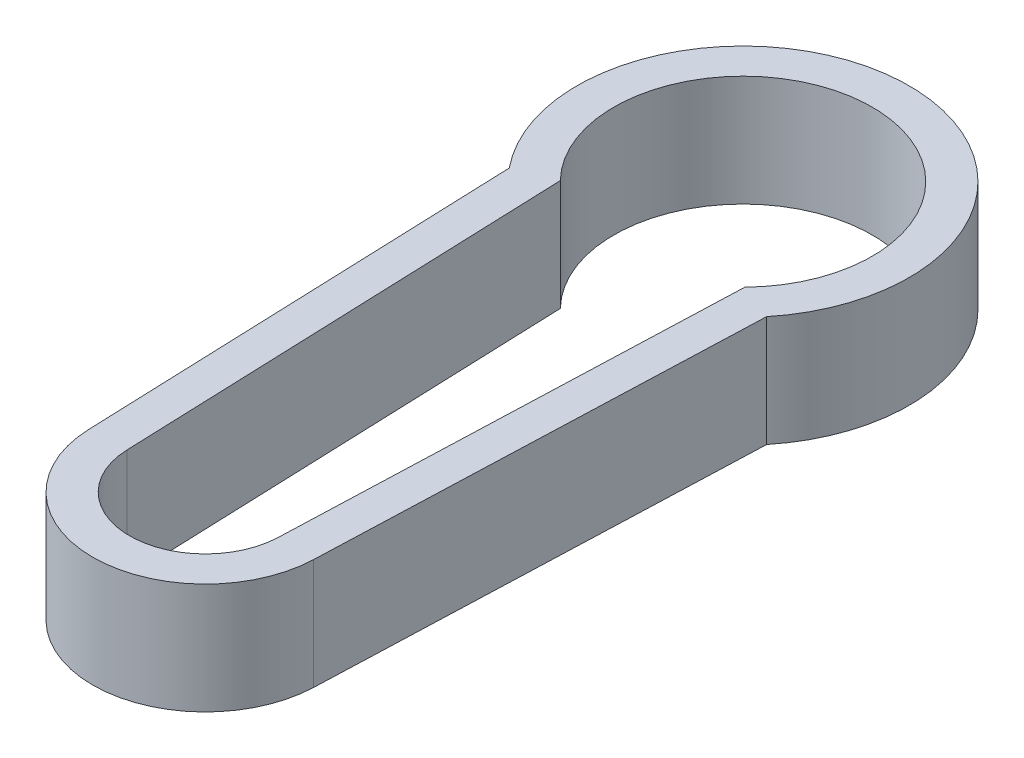
ISO-10303-21;
HEADER;
FILE_DESCRIPTION(('STEP AP214'),'2;1');
FILE_NAME('part.step','',(''),(''),'','','');
FILE_SCHEMA(('AUTOMOTIVE_DESIGN { 1 0 10303 214 1 1 1 1 }'));
ENDSEC;
DATA;
#1=APPLICATION_CONTEXT('core data for automotive mechanical design processes');
#2=APPLICATION_PROTOCOL_DEFINITION('international standard','automotive_design',2000,#1);
#3=PRODUCT_CONTEXT('',#1,'mechanical');
#4=PRODUCT('Part','Part','',(#3));
#5=PRODUCT_RELATED_PRODUCT_CATEGORY('part','',(#4));
#6=PRODUCT_DEFINITION_FORMATION('','',#4);
#7=PRODUCT_DEFINITION_CONTEXT('part definition',#1,'design');
#8=PRODUCT_DEFINITION('design','',#6,#7);
#9=PRODUCT_DEFINITION_SHAPE('','',#8);
#10=(LENGTH_UNIT() NAMED_UNIT(*) SI_UNIT(.MILLI.,.METRE.));
#11=(NAMED_UNIT(*) PLANE_ANGLE_UNIT() SI_UNIT($,.RADIAN.));
#12=(NAMED_UNIT(*) SI_UNIT($,.STERADIAN.) SOLID_ANGLE_UNIT());
#13=UNCERTAINTY_MEASURE_WITH_UNIT(LENGTH_MEASURE(1.E-05),#10,'distance_accuracy_value','');
#14=(GEOMETRIC_REPRESENTATION_CONTEXT(3) GLOBAL_UNCERTAINTY_ASSIGNED_CONTEXT((#13)) GLOBAL_UNIT_ASSIGNED_CONTEXT((#10,
#11,#12)) REPRESENTATION_CONTEXT('',''));
#15=CARTESIAN_POINT('',(0.,0.,0.));
#16=DIRECTION('',(0.,0.,1.));
#17=DIRECTION('',(1.,0.,0.));
#18=AXIS2_PLACEMENT_3D('',#15,#16,#17);
#19=CARTESIAN_POINT('',(0.,3.,0.));
#20=DIRECTION('',(0.,1.,0.));
#21=DIRECTION('',(0.,0.,1.));
#22=AXIS2_PLACEMENT_3D('',#19,#20,#21);
#23=PLANE('',#22);
#24=CARTESIAN_POINT('',(0.,3.,0.));
#25=DIRECTION('',(0.,1.,0.));
#26=DIRECTION('',(0.,0.,1.));
#27=AXIS2_PLACEMENT_3D('',#24,#25,#26);
#28=CIRCLE('',#27,4.5);
#29=CARTESIAN_POINT('',(3.4860607649293,3.,2.84558963015059));
#30=VERTEX_POINT('',#29);
#31=CARTESIAN_POINT('',(-3.4860607649293,3.,2.84558963015059));
#32=VERTEX_POINT('',#31);
#33=EDGE_CURVE('E153',#30,#32,#28,.T.);
#34=ORIENTED_EDGE('',*,*,#33,.T.);
#35=DIRECTION('',(0.0368852459016394,0.,0.999319507782559));
#36=VECTOR('',#35,1.);
#37=CARTESIAN_POINT('',(-3.4860607649293,3.,2.84558963015059));
#38=LINE('',#37,#36);
#39=CARTESIAN_POINT('',(-3.04931950778256,3.,14.678072983632));
#40=VERTEX_POINT('',#39);
#41=EDGE_CURVE('E157',#32,#40,#38,.T.);
#42=ORIENTED_EDGE('',*,*,#41,.T.);
#43=CARTESIAN_POINT('',(0.,3.,14.5655214933416));
#44=DIRECTION('',(0.,1.,0.));
#45=DIRECTION('',(0.,0.,1.));
#46=AXIS2_PLACEMENT_3D('',#43,#44,#45);
#47=CIRCLE('',#46,3.05139595898498);
#48=CARTESIAN_POINT('',(3.04931950778256,3.,14.678072983632));
#49=VERTEX_POINT('',#48);
#50=EDGE_CURVE('E161',#40,#49,#47,.T.);
#51=ORIENTED_EDGE('',*,*,#50,.T.);
#52=DIRECTION('',(0.0368852459016394,0.,-0.999319507782559));
#53=VECTOR('',#52,1.);
#54=CARTESIAN_POINT('',(3.4860607649293,3.,2.84558963015059));
#55=LINE('',#54,#53);
#56=EDGE_CURVE('E164',#49,#30,#55,.T.);
#57=ORIENTED_EDGE('',*,*,#56,.T.);
#58=EDGE_LOOP('',(#34,#42,#51,#57));
#59=FACE_BOUND('',#58,.T.);
#60=DIRECTION('',(0.0368852459016394,0.,0.999319507782559));
#61=VECTOR('',#60,1.);
#62=CARTESIAN_POINT('',(-2.5,3.,2.44948974278318));
#63=LINE('',#62,#61);
#64=CARTESIAN_POINT('',(-2.5,3.,2.44948974278318));
#65=VERTEX_POINT('',#64);
#66=CARTESIAN_POINT('',(-2.05,3.,14.6411877377304));
#67=VERTEX_POINT('',#66);
#68=EDGE_CURVE('E114',#65,#67,#63,.T.);
#69=ORIENTED_EDGE('',*,*,#68,.F.);
#70=CARTESIAN_POINT('',(0.,3.,0.));
#71=DIRECTION('',(0.,1.,0.));
#72=DIRECTION('',(0.,0.,1.));
#73=AXIS2_PLACEMENT_3D('',#70,#71,#72);
#74=CIRCLE('',#73,3.5);
#75=CARTESIAN_POINT('',(2.5,3.,2.44948974278318));
#76=VERTEX_POINT('',#75);
#77=EDGE_CURVE('E105',#76,#65,#74,.T.);
#78=ORIENTED_EDGE('',*,*,#77,.F.);
#79=DIRECTION('',(0.0368852459016394,0.,-0.999319507782559));
#80=VECTOR('',#79,1.);
#81=CARTESIAN_POINT('',(2.5,3.,2.44948974278318));
#82=LINE('',#81,#80);
#83=CARTESIAN_POINT('',(2.05,3.,14.6411877377304));
#84=VERTEX_POINT('',#83);
#85=EDGE_CURVE('E131',#84,#76,#82,.T.);
#86=ORIENTED_EDGE('',*,*,#85,.F.);
#87=CARTESIAN_POINT('',(0.,3.,14.5655214933416));
#88=DIRECTION('',(0.,1.,0.));
#89=DIRECTION('',(0.,0.,1.));
#90=AXIS2_PLACEMENT_3D('',#87,#88,#89);
#91=CIRCLE('',#90,2.05139595898498);
#92=EDGE_CURVE('E127',#67,#84,#91,.T.);
#93=ORIENTED_EDGE('',*,*,#92,.F.);
#94=EDGE_LOOP('',(#69,#78,#86,#93));
#95=FACE_BOUND('',#94,.T.);
#96=ADVANCED_FACE('F39',(#59,#95),#23,.T.);
#97=CARTESIAN_POINT('',(0.,0.,0.));
#98=DIRECTION('',(0.,1.,0.));
#99=DIRECTION('',(0.,0.,1.));
#100=AXIS2_PLACEMENT_3D('',#97,#98,#99);
#101=PLANE('',#100);
#102=CARTESIAN_POINT('',(0.,0.,0.));
#103=DIRECTION('',(0.,1.,0.));
#104=DIRECTION('',(0.,0.,1.));
#105=AXIS2_PLACEMENT_3D('',#102,#103,#104);
#106=CIRCLE('',#105,4.5);
#107=CARTESIAN_POINT('',(3.4860607649293,0.,2.84558963015059));
#108=VERTEX_POINT('',#107);
#109=CARTESIAN_POINT('',(-3.4860607649293,0.,2.84558963015059));
#110=VERTEX_POINT('',#109);
#111=EDGE_CURVE('E123',#108,#110,#106,.T.);
#112=ORIENTED_EDGE('',*,*,#111,.F.);
#113=DIRECTION('',(0.0368852459016394,0.,-0.999319507782559));
#114=VECTOR('',#113,1.);
#115=CARTESIAN_POINT('',(3.4860607649293,0.,2.84558963015059));
#116=LINE('',#115,#114);
#117=CARTESIAN_POINT('',(3.04931950778256,0.,14.678072983632));
#118=VERTEX_POINT('',#117);
#119=EDGE_CURVE('E158',#118,#108,#116,.T.);
#120=ORIENTED_EDGE('',*,*,#119,.F.);
#121=CARTESIAN_POINT('',(0.,0.,14.5655214933416));
#122=DIRECTION('',(0.,1.,0.));
#123=DIRECTION('',(0.,0.,1.));
#124=AXIS2_PLACEMENT_3D('',#121,#122,#123);
#125=CIRCLE('',#124,3.05139595898498);
#126=CARTESIAN_POINT('',(-3.04931950778256,0.,14.678072983632));
#127=VERTEX_POINT('',#126);
#128=EDGE_CURVE('E174',#127,#118,#125,.T.);
#129=ORIENTED_EDGE('',*,*,#128,.F.);
#130=DIRECTION('',(0.0368852459016394,0.,0.999319507782559));
#131=VECTOR('',#130,1.);
#132=CARTESIAN_POINT('',(-3.4860607649293,0.,2.84558963015059));
#133=LINE('',#132,#131);
#134=EDGE_CURVE('E171',#110,#127,#133,.T.);
#135=ORIENTED_EDGE('',*,*,#134,.F.);
#136=EDGE_LOOP('',(#112,#120,#129,#135));
#137=FACE_BOUND('',#136,.T.);
#138=CARTESIAN_POINT('',(0.,0.,0.));
#139=DIRECTION('',(0.,1.,0.));
#140=DIRECTION('',(0.,0.,1.));
#141=AXIS2_PLACEMENT_3D('',#138,#139,#140);
#142=CIRCLE('',#141,3.5);
#143=CARTESIAN_POINT('',(2.5,0.,2.44948974278318));
#144=VERTEX_POINT('',#143);
#145=CARTESIAN_POINT('',(-2.5,0.,2.44948974278318));
#146=VERTEX_POINT('',#145);
#147=EDGE_CURVE('E63',#144,#146,#142,.T.);
#148=ORIENTED_EDGE('',*,*,#147,.T.);
#149=DIRECTION('',(0.0368852459016394,0.,0.999319507782559));
#150=VECTOR('',#149,1.);
#151=CARTESIAN_POINT('',(-2.5,0.,2.44948974278318));
#152=LINE('',#151,#150);
#153=CARTESIAN_POINT('',(-2.05,0.,14.6411877377304));
#154=VERTEX_POINT('',#153);
#155=EDGE_CURVE('E121',#146,#154,#152,.T.);
#156=ORIENTED_EDGE('',*,*,#155,.T.);
#157=CARTESIAN_POINT('',(0.,0.,14.5655214933416));
#158=DIRECTION('',(0.,1.,0.));
#159=DIRECTION('',(0.,0.,1.));
#160=AXIS2_PLACEMENT_3D('',#157,#158,#159);
#161=CIRCLE('',#160,2.05139595898498);
#162=CARTESIAN_POINT('',(2.05,0.,14.6411877377304));
#163=VERTEX_POINT('',#162);
#164=EDGE_CURVE('E140',#154,#163,#161,.T.);
#165=ORIENTED_EDGE('',*,*,#164,.T.);
#166=DIRECTION('',(0.0368852459016394,0.,-0.999319507782559));
#167=VECTOR('',#166,1.);
#168=CARTESIAN_POINT('',(2.5,0.,2.44948974278318));
#169=LINE('',#168,#167);
#170=EDGE_CURVE('E115',#163,#144,#169,.T.);
#171=ORIENTED_EDGE('',*,*,#170,.T.);
#172=EDGE_LOOP('',(#148,#156,#165,#171));
#173=FACE_BOUND('',#172,.T.);
#174=ADVANCED_FACE('F197',(#137,#173),#101,.F.);
#175=CARTESIAN_POINT('',(0.,3.,0.));
#176=DIRECTION('',(0.,-1.,0.));
#177=DIRECTION('',(0.,0.,-1.));
#178=AXIS2_PLACEMENT_3D('',#175,#176,#177);
#179=CYLINDRICAL_SURFACE('',#178,4.5);
#180=ORIENTED_EDGE('',*,*,#111,.T.);
#181=DIRECTION('',(0.,-1.,0.));
#182=VECTOR('',#181,1.);
#183=CARTESIAN_POINT('',(-3.4860607649293,3.,2.84558963015059));
#184=LINE('',#183,#182);
#185=EDGE_CURVE('E11',#32,#110,#184,.T.);
#186=ORIENTED_EDGE('',*,*,#185,.F.);
#187=ORIENTED_EDGE('',*,*,#33,.F.);
#188=DIRECTION('',(0.,-1.,0.));
#189=VECTOR('',#188,1.);
#190=CARTESIAN_POINT('',(3.4860607649293,3.,2.84558963015059));
#191=LINE('',#190,#189);
#192=EDGE_CURVE('E167',#30,#108,#191,.T.);
#193=ORIENTED_EDGE('',*,*,#192,.T.);
#194=EDGE_LOOP('',(#180,#186,#187,#193));
#195=FACE_BOUND('',#194,.T.);
#196=ADVANCED_FACE('F41',(#195),#179,.T.);
#197=CARTESIAN_POINT('',(-3.4860607649293,3.,2.84558963015059));
#198=DIRECTION('',(0.999319507782559,0.,-0.0368852459016394));
#199=DIRECTION('',(-0.0368852459016394,0.,-0.999319507782559));
#200=AXIS2_PLACEMENT_3D('',#197,#198,#199);
#201=PLANE('',#200);
#202=ORIENTED_EDGE('',*,*,#134,.T.);
#203=DIRECTION('',(0.,-1.,0.));
#204=VECTOR('',#203,1.);
#205=CARTESIAN_POINT('',(-3.04931950778256,3.,14.678072983632));
#206=LINE('',#205,#204);
#207=EDGE_CURVE('E48',#40,#127,#206,.T.);
#208=ORIENTED_EDGE('',*,*,#207,.F.);
#209=ORIENTED_EDGE('',*,*,#41,.F.);
#210=ORIENTED_EDGE('',*,*,#185,.T.);
#211=EDGE_LOOP('',(#202,#208,#209,#210));
#212=FACE_BOUND('',#211,.T.);
#213=ADVANCED_FACE('F207',(#212),#201,.F.);
#214=CARTESIAN_POINT('',(0.,3.,14.5655214933416));
#215=DIRECTION('',(0.,-1.,0.));
#216=DIRECTION('',(0.,0.,-1.));
#217=AXIS2_PLACEMENT_3D('',#214,#215,#216);
#218=CYLINDRICAL_SURFACE('',#217,3.05139595898498);
#219=ORIENTED_EDGE('',*,*,#128,.T.);
#220=DIRECTION('',(0.,-1.,0.));
#221=VECTOR('',#220,1.);
#222=CARTESIAN_POINT('',(3.04931950778256,3.,14.678072983632));
#223=LINE('',#222,#221);
#224=EDGE_CURVE('E182',#49,#118,#223,.T.);
#225=ORIENTED_EDGE('',*,*,#224,.F.);
#226=ORIENTED_EDGE('',*,*,#50,.F.);
#227=ORIENTED_EDGE('',*,*,#207,.T.);
#228=EDGE_LOOP('',(#219,#225,#226,#227));
#229=FACE_BOUND('',#228,.T.);
#230=ADVANCED_FACE('F191',(#229),#218,.T.);
#231=CARTESIAN_POINT('',(3.4860607649293,3.,2.84558963015059));
#232=DIRECTION('',(-0.999319507782559,0.,-0.0368852459016394));
#233=DIRECTION('',(-0.0368852459016394,0.,0.999319507782559));
#234=AXIS2_PLACEMENT_3D('',#231,#232,#233);
#235=PLANE('',#234);
#236=ORIENTED_EDGE('',*,*,#119,.T.);
#237=ORIENTED_EDGE('',*,*,#192,.F.);
#238=ORIENTED_EDGE('',*,*,#56,.F.);
#239=ORIENTED_EDGE('',*,*,#224,.T.);
#240=EDGE_LOOP('',(#236,#237,#238,#239));
#241=FACE_BOUND('',#240,.T.);
#242=ADVANCED_FACE('F201',(#241),#235,.F.);
#243=CARTESIAN_POINT('',(0.,3.,0.));
#244=DIRECTION('',(0.,-1.,0.));
#245=DIRECTION('',(0.,0.,-1.));
#246=AXIS2_PLACEMENT_3D('',#243,#244,#245);
#247=CYLINDRICAL_SURFACE('',#246,3.5);
#248=ORIENTED_EDGE('',*,*,#147,.F.);
#249=DIRECTION('',(0.,-1.,0.));
#250=VECTOR('',#249,1.);
#251=CARTESIAN_POINT('',(2.5,3.,2.44948974278318));
#252=LINE('',#251,#250);
#253=EDGE_CURVE('E109',#76,#144,#252,.T.);
#254=ORIENTED_EDGE('',*,*,#253,.F.);
#255=ORIENTED_EDGE('',*,*,#77,.T.);
#256=DIRECTION('',(0.,-1.,0.));
#257=VECTOR('',#256,1.);
#258=CARTESIAN_POINT('',(-2.5,3.,2.44948974278318));
#259=LINE('',#258,#257);
#260=EDGE_CURVE('E108',#65,#146,#259,.T.);
#261=ORIENTED_EDGE('',*,*,#260,.T.);
#262=EDGE_LOOP('',(#248,#254,#255,#261));
#263=FACE_BOUND('',#262,.T.);
#264=ADVANCED_FACE('F107',(#263),#247,.F.);
#265=CARTESIAN_POINT('',(-2.5,3.,2.44948974278318));
#266=DIRECTION('',(0.999319507782559,0.,-0.0368852459016394));
#267=DIRECTION('',(-0.0368852459016394,0.,-0.999319507782559));
#268=AXIS2_PLACEMENT_3D('',#265,#266,#267);
#269=PLANE('',#268);
#270=ORIENTED_EDGE('',*,*,#155,.F.);
#271=ORIENTED_EDGE('',*,*,#260,.F.);
#272=ORIENTED_EDGE('',*,*,#68,.T.);
#273=DIRECTION('',(0.,-1.,0.));
#274=VECTOR('',#273,1.);
#275=CARTESIAN_POINT('',(-2.05,3.,14.6411877377304));
#276=LINE('',#275,#274);
#277=EDGE_CURVE('E124',#67,#154,#276,.T.);
#278=ORIENTED_EDGE('',*,*,#277,.T.);
#279=EDGE_LOOP('',(#270,#271,#272,#278));
#280=FACE_BOUND('',#279,.T.);
#281=ADVANCED_FACE('F118',(#280),#269,.T.);
#282=CARTESIAN_POINT('',(0.,3.,14.5655214933416));
#283=DIRECTION('',(0.,-1.,0.));
#284=DIRECTION('',(0.,0.,-1.));
#285=AXIS2_PLACEMENT_3D('',#282,#283,#284);
#286=CYLINDRICAL_SURFACE('',#285,2.05139595898498);
#287=ORIENTED_EDGE('',*,*,#164,.F.);
#288=ORIENTED_EDGE('',*,*,#277,.F.);
#289=ORIENTED_EDGE('',*,*,#92,.T.);
#290=DIRECTION('',(0.,-1.,0.));
#291=VECTOR('',#290,1.);
#292=CARTESIAN_POINT('',(2.05,3.,14.6411877377304));
#293=LINE('',#292,#291);
#294=EDGE_CURVE('E55',#84,#163,#293,.T.);
#295=ORIENTED_EDGE('',*,*,#294,.T.);
#296=EDGE_LOOP('',(#287,#288,#289,#295));
#297=FACE_BOUND('',#296,.T.);
#298=ADVANCED_FACE('F230',(#297),#286,.F.);
#299=CARTESIAN_POINT('',(2.5,3.,2.44948974278318));
#300=DIRECTION('',(-0.999319507782559,0.,-0.0368852459016394));
#301=DIRECTION('',(-0.0368852459016394,0.,0.999319507782559));
#302=AXIS2_PLACEMENT_3D('',#299,#300,#301);
#303=PLANE('',#302);
#304=ORIENTED_EDGE('',*,*,#170,.F.);
#305=ORIENTED_EDGE('',*,*,#294,.F.);
#306=ORIENTED_EDGE('',*,*,#85,.T.);
#307=ORIENTED_EDGE('',*,*,#253,.T.);
#308=EDGE_LOOP('',(#304,#305,#306,#307));
#309=FACE_BOUND('',#308,.T.);
#310=ADVANCED_FACE('F234',(#309),#303,.T.);
#311=CLOSED_SHELL('',(#96,#174,#196,#213,#230,#242,#264,#281,#298,#310));
#312=MANIFOLD_SOLID_BREP('B2',#311);
#313=ADVANCED_BREP_SHAPE_REPRESENTATION('',(#18,#312),#14);
#314=SHAPE_DEFINITION_REPRESENTATION(#9,#313);
ENDSEC;
END-ISO-10303-21;
